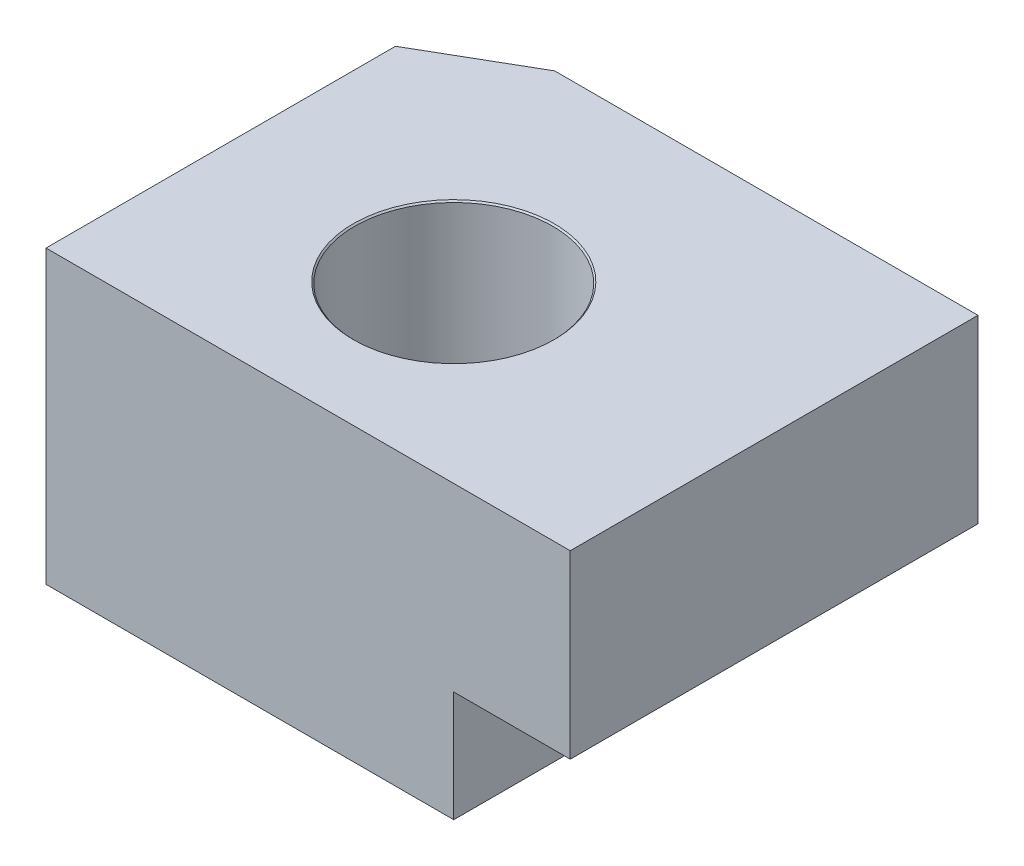
ISO-10303-21;
HEADER;
FILE_DESCRIPTION(('STEP AP214'),'2;1');
FILE_NAME('part.step','',(''),(''),'','','');
FILE_SCHEMA(('AUTOMOTIVE_DESIGN { 1 0 10303 214 1 1 1 1 }'));
ENDSEC;
DATA;
#1=APPLICATION_CONTEXT('core data for automotive mechanical design processes');
#2=APPLICATION_PROTOCOL_DEFINITION('international standard','automotive_design',2000,#1);
#3=PRODUCT_CONTEXT('',#1,'mechanical');
#4=PRODUCT('Part','Part','',(#3));
#5=PRODUCT_RELATED_PRODUCT_CATEGORY('part','',(#4));
#6=PRODUCT_DEFINITION_FORMATION('','',#4);
#7=PRODUCT_DEFINITION_CONTEXT('part definition',#1,'design');
#8=PRODUCT_DEFINITION('design','',#6,#7);
#9=PRODUCT_DEFINITION_SHAPE('','',#8);
#10=(LENGTH_UNIT() NAMED_UNIT(*) SI_UNIT(.MILLI.,.METRE.));
#11=(NAMED_UNIT(*) PLANE_ANGLE_UNIT() SI_UNIT($,.RADIAN.));
#12=(NAMED_UNIT(*) SI_UNIT($,.STERADIAN.) SOLID_ANGLE_UNIT());
#13=UNCERTAINTY_MEASURE_WITH_UNIT(LENGTH_MEASURE(1.E-05),#10,'distance_accuracy_value','');
#14=(GEOMETRIC_REPRESENTATION_CONTEXT(3) GLOBAL_UNCERTAINTY_ASSIGNED_CONTEXT((#13)) GLOBAL_UNIT_ASSIGNED_CONTEXT((#10,
#11,#12)) REPRESENTATION_CONTEXT('',''));
#15=CARTESIAN_POINT('',(0.,0.,0.));
#16=DIRECTION('',(0.,0.,1.));
#17=DIRECTION('',(1.,0.,0.));
#18=AXIS2_PLACEMENT_3D('',#15,#16,#17);
#19=CARTESIAN_POINT('',(-7.,0.,7.));
#20=DIRECTION('',(0.,1.,0.));
#21=DIRECTION('',(0.,0.,1.));
#22=AXIS2_PLACEMENT_3D('',#19,#20,#21);
#23=PLANE('',#22);
#24=CARTESIAN_POINT('',(-3.,0.,4.));
#25=DIRECTION('',(0.,1.,0.));
#26=DIRECTION('',(0.,0.,1.));
#27=AXIS2_PLACEMENT_3D('',#24,#25,#26);
#28=CIRCLE('',#27,1.725);
#29=CARTESIAN_POINT('',(-3.,0.,5.725));
#30=VERTEX_POINT('',#29);
#31=EDGE_CURVE('E150',#30,#30,#28,.T.);
#32=ORIENTED_EDGE('',*,*,#31,.T.);
#33=EDGE_LOOP('',(#32));
#34=FACE_BOUND('',#33,.T.);
#35=DIRECTION('',(0.,0.,-1.));
#36=VECTOR('',#35,1.);
#37=CARTESIAN_POINT('',(-7.,0.,7.));
#38=LINE('',#37,#36);
#39=CARTESIAN_POINT('',(-7.,0.,7.));
#40=VERTEX_POINT('',#39);
#41=CARTESIAN_POINT('',(-7.,0.,1.));
#42=VERTEX_POINT('',#41);
#43=EDGE_CURVE('E125',#40,#42,#38,.T.);
#44=ORIENTED_EDGE('',*,*,#43,.T.);
#45=DIRECTION('',(-0.866025403784438,0.,0.500000000000001));
#46=VECTOR('',#45,1.);
#47=CARTESIAN_POINT('',(-7.,0.,1.));
#48=LINE('',#47,#46);
#49=CARTESIAN_POINT('',(-5.26794919243112,0.,0.));
#50=VERTEX_POINT('',#49);
#51=EDGE_CURVE('E52',#42,#50,#48,.F.);
#52=ORIENTED_EDGE('',*,*,#51,.T.);
#53=DIRECTION('',(1.,0.,0.));
#54=VECTOR('',#53,1.);
#55=CARTESIAN_POINT('',(-7.,0.,0.));
#56=LINE('',#55,#54);
#57=CARTESIAN_POINT('',(0.,0.,0.));
#58=VERTEX_POINT('',#57);
#59=EDGE_CURVE('E107',#50,#58,#56,.T.);
#60=ORIENTED_EDGE('',*,*,#59,.T.);
#61=DIRECTION('',(0.,0.,-1.));
#62=VECTOR('',#61,1.);
#63=CARTESIAN_POINT('',(0.,0.,7.));
#64=LINE('',#63,#62);
#65=CARTESIAN_POINT('',(0.,0.,7.));
#66=VERTEX_POINT('',#65);
#67=EDGE_CURVE('E92',#66,#58,#64,.T.);
#68=ORIENTED_EDGE('',*,*,#67,.F.);
#69=DIRECTION('',(1.,0.,0.));
#70=VECTOR('',#69,1.);
#71=CARTESIAN_POINT('',(-7.,0.,7.));
#72=LINE('',#71,#70);
#73=EDGE_CURVE('E98',#40,#66,#72,.T.);
#74=ORIENTED_EDGE('',*,*,#73,.F.);
#75=EDGE_LOOP('',(#44,#52,#60,#68,#74));
#76=FACE_BOUND('',#75,.T.);
#77=ADVANCED_FACE('F30',(#34,#76),#23,.F.);
#78=CARTESIAN_POINT('',(0.,0.,7.));
#79=DIRECTION('',(-1.,0.,0.));
#80=DIRECTION('',(0.,0.,1.));
#81=AXIS2_PLACEMENT_3D('',#78,#79,#80);
#82=PLANE('',#81);
#83=DIRECTION('',(0.,1.,0.));
#84=VECTOR('',#83,1.);
#85=CARTESIAN_POINT('',(0.,0.,0.));
#86=LINE('',#85,#84);
#87=CARTESIAN_POINT('',(0.,1.9,0.));
#88=VERTEX_POINT('',#87);
#89=EDGE_CURVE('E132',#58,#88,#86,.T.);
#90=ORIENTED_EDGE('',*,*,#89,.T.);
#91=DIRECTION('',(0.,0.,-1.));
#92=VECTOR('',#91,1.);
#93=CARTESIAN_POINT('',(0.,1.9,7.));
#94=LINE('',#93,#92);
#95=CARTESIAN_POINT('',(0.,1.9,7.));
#96=VERTEX_POINT('',#95);
#97=EDGE_CURVE('E94',#96,#88,#94,.T.);
#98=ORIENTED_EDGE('',*,*,#97,.F.);
#99=DIRECTION('',(0.,1.,0.));
#100=VECTOR('',#99,1.);
#101=CARTESIAN_POINT('',(0.,0.,7.));
#102=LINE('',#101,#100);
#103=EDGE_CURVE('E88',#66,#96,#102,.T.);
#104=ORIENTED_EDGE('',*,*,#103,.F.);
#105=ORIENTED_EDGE('',*,*,#67,.T.);
#106=EDGE_LOOP('',(#90,#98,#104,#105));
#107=FACE_BOUND('',#106,.T.);
#108=ADVANCED_FACE('F90',(#107),#82,.F.);
#109=CARTESIAN_POINT('',(0.,1.9,7.));
#110=DIRECTION('',(0.,1.,0.));
#111=DIRECTION('',(0.,0.,1.));
#112=AXIS2_PLACEMENT_3D('',#109,#110,#111);
#113=PLANE('',#112);
#114=DIRECTION('',(1.,0.,0.));
#115=VECTOR('',#114,1.);
#116=CARTESIAN_POINT('',(0.,1.9,0.));
#117=LINE('',#116,#115);
#118=CARTESIAN_POINT('',(2.,1.9,0.));
#119=VERTEX_POINT('',#118);
#120=EDGE_CURVE('E130',#88,#119,#117,.T.);
#121=ORIENTED_EDGE('',*,*,#120,.T.);
#122=DIRECTION('',(0.,0.,-1.));
#123=VECTOR('',#122,1.);
#124=CARTESIAN_POINT('',(2.,1.9,7.));
#125=LINE('',#124,#123);
#126=CARTESIAN_POINT('',(2.,1.9,7.));
#127=VERTEX_POINT('',#126);
#128=EDGE_CURVE('E113',#127,#119,#125,.T.);
#129=ORIENTED_EDGE('',*,*,#128,.F.);
#130=DIRECTION('',(1.,0.,0.));
#131=VECTOR('',#130,1.);
#132=CARTESIAN_POINT('',(0.,1.9,7.));
#133=LINE('',#132,#131);
#134=EDGE_CURVE('E97',#96,#127,#133,.T.);
#135=ORIENTED_EDGE('',*,*,#134,.F.);
#136=ORIENTED_EDGE('',*,*,#97,.T.);
#137=EDGE_LOOP('',(#121,#129,#135,#136));
#138=FACE_BOUND('',#137,.T.);
#139=ADVANCED_FACE('F193',(#138),#113,.F.);
#140=CARTESIAN_POINT('',(2.,1.9,7.));
#141=DIRECTION('',(-1.,0.,0.));
#142=DIRECTION('',(0.,0.,1.));
#143=AXIS2_PLACEMENT_3D('',#140,#141,#142);
#144=PLANE('',#143);
#145=DIRECTION('',(0.,1.,0.));
#146=VECTOR('',#145,1.);
#147=CARTESIAN_POINT('',(2.,1.9,0.));
#148=LINE('',#147,#146);
#149=CARTESIAN_POINT('',(2.,5.,0.));
#150=VERTEX_POINT('',#149);
#151=EDGE_CURVE('E128',#119,#150,#148,.T.);
#152=ORIENTED_EDGE('',*,*,#151,.T.);
#153=DIRECTION('',(0.,0.,-1.));
#154=VECTOR('',#153,1.);
#155=CARTESIAN_POINT('',(2.,5.,7.));
#156=LINE('',#155,#154);
#157=CARTESIAN_POINT('',(2.,5.,7.));
#158=VERTEX_POINT('',#157);
#159=EDGE_CURVE('E119',#158,#150,#156,.T.);
#160=ORIENTED_EDGE('',*,*,#159,.F.);
#161=DIRECTION('',(0.,1.,0.));
#162=VECTOR('',#161,1.);
#163=CARTESIAN_POINT('',(2.,1.9,7.));
#164=LINE('',#163,#162);
#165=EDGE_CURVE('E139',#127,#158,#164,.T.);
#166=ORIENTED_EDGE('',*,*,#165,.F.);
#167=ORIENTED_EDGE('',*,*,#128,.T.);
#168=EDGE_LOOP('',(#152,#160,#166,#167));
#169=FACE_BOUND('',#168,.T.);
#170=ADVANCED_FACE('F178',(#169),#144,.F.);
#171=CARTESIAN_POINT('',(2.,5.,7.));
#172=DIRECTION('',(0.,-1.,0.));
#173=DIRECTION('',(1.,0.,0.));
#174=AXIS2_PLACEMENT_3D('',#171,#172,#173);
#175=PLANE('',#174);
#176=CARTESIAN_POINT('',(-3.,5.,4.));
#177=DIRECTION('',(0.,1.,0.));
#178=DIRECTION('',(0.,0.,1.));
#179=AXIS2_PLACEMENT_3D('',#176,#177,#178);
#180=CIRCLE('',#179,1.725);
#181=CARTESIAN_POINT('',(-3.,5.,5.725));
#182=VERTEX_POINT('',#181);
#183=EDGE_CURVE('E147',#182,#182,#180,.T.);
#184=ORIENTED_EDGE('',*,*,#183,.F.);
#185=EDGE_LOOP('',(#184));
#186=FACE_BOUND('',#185,.T.);
#187=DIRECTION('',(-1.,0.,0.));
#188=VECTOR('',#187,1.);
#189=CARTESIAN_POINT('',(2.,5.,0.));
#190=LINE('',#189,#188);
#191=CARTESIAN_POINT('',(-5.26794919243111,5.,0.));
#192=VERTEX_POINT('',#191);
#193=EDGE_CURVE('E105',#150,#192,#190,.T.);
#194=ORIENTED_EDGE('',*,*,#193,.T.);
#195=DIRECTION('',(0.866025403784438,0.,-0.500000000000001));
#196=VECTOR('',#195,1.);
#197=CARTESIAN_POINT('',(-7.,5.,1.));
#198=LINE('',#197,#196);
#199=CARTESIAN_POINT('',(-7.,5.,1.));
#200=VERTEX_POINT('',#199);
#201=EDGE_CURVE('E11',#192,#200,#198,.F.);
#202=ORIENTED_EDGE('',*,*,#201,.T.);
#203=DIRECTION('',(0.,0.,-1.));
#204=VECTOR('',#203,1.);
#205=CARTESIAN_POINT('',(-7.,5.,7.));
#206=LINE('',#205,#204);
#207=CARTESIAN_POINT('',(-7.,5.,7.));
#208=VERTEX_POINT('',#207);
#209=EDGE_CURVE('E122',#208,#200,#206,.T.);
#210=ORIENTED_EDGE('',*,*,#209,.F.);
#211=DIRECTION('',(-1.,0.,0.));
#212=VECTOR('',#211,1.);
#213=CARTESIAN_POINT('',(2.,5.,7.));
#214=LINE('',#213,#212);
#215=EDGE_CURVE('E137',#158,#208,#214,.T.);
#216=ORIENTED_EDGE('',*,*,#215,.F.);
#217=ORIENTED_EDGE('',*,*,#159,.T.);
#218=EDGE_LOOP('',(#194,#202,#210,#216,#217));
#219=FACE_BOUND('',#218,.T.);
#220=ADVANCED_FACE('F174',(#186,#219),#175,.F.);
#221=CARTESIAN_POINT('',(-7.,5.,7.));
#222=DIRECTION('',(1.,0.,0.));
#223=DIRECTION('',(0.,0.,-1.));
#224=AXIS2_PLACEMENT_3D('',#221,#222,#223);
#225=PLANE('',#224);
#226=ORIENTED_EDGE('',*,*,#209,.T.);
#227=DIRECTION('',(0.,-1.,0.));
#228=VECTOR('',#227,1.);
#229=CARTESIAN_POINT('',(-7.,5.,1.));
#230=LINE('',#229,#228);
#231=EDGE_CURVE('E109',#200,#42,#230,.T.);
#232=ORIENTED_EDGE('',*,*,#231,.T.);
#233=ORIENTED_EDGE('',*,*,#43,.F.);
#234=DIRECTION('',(0.,-1.,0.));
#235=VECTOR('',#234,1.);
#236=CARTESIAN_POINT('',(-7.,5.,7.));
#237=LINE('',#236,#235);
#238=EDGE_CURVE('E103',#208,#40,#237,.T.);
#239=ORIENTED_EDGE('',*,*,#238,.F.);
#240=EDGE_LOOP('',(#226,#232,#233,#239));
#241=FACE_BOUND('',#240,.T.);
#242=ADVANCED_FACE('F177',(#241),#225,.F.);
#243=CARTESIAN_POINT('',(0.,0.,7.));
#244=DIRECTION('',(0.,0.,1.));
#245=DIRECTION('',(1.,0.,0.));
#246=AXIS2_PLACEMENT_3D('',#243,#244,#245);
#247=PLANE('',#246);
#248=ORIENTED_EDGE('',*,*,#73,.T.);
#249=ORIENTED_EDGE('',*,*,#103,.T.);
#250=ORIENTED_EDGE('',*,*,#134,.T.);
#251=ORIENTED_EDGE('',*,*,#165,.T.);
#252=ORIENTED_EDGE('',*,*,#215,.T.);
#253=ORIENTED_EDGE('',*,*,#238,.T.);
#254=EDGE_LOOP('',(#248,#249,#250,#251,#252,#253));
#255=FACE_BOUND('',#254,.T.);
#256=ADVANCED_FACE('F101',(#255),#247,.T.);
#257=CARTESIAN_POINT('',(0.,0.,0.));
#258=DIRECTION('',(0.,0.,1.));
#259=DIRECTION('',(1.,0.,0.));
#260=AXIS2_PLACEMENT_3D('',#257,#258,#259);
#261=PLANE('',#260);
#262=ORIENTED_EDGE('',*,*,#59,.F.);
#263=DIRECTION('',(0.,1.,0.));
#264=VECTOR('',#263,1.);
#265=CARTESIAN_POINT('',(-5.26794919243112,0.,0.));
#266=LINE('',#265,#264);
#267=EDGE_CURVE('E38',#50,#192,#266,.T.);
#268=ORIENTED_EDGE('',*,*,#267,.T.);
#269=ORIENTED_EDGE('',*,*,#193,.F.);
#270=ORIENTED_EDGE('',*,*,#151,.F.);
#271=ORIENTED_EDGE('',*,*,#120,.F.);
#272=ORIENTED_EDGE('',*,*,#89,.F.);
#273=EDGE_LOOP('',(#262,#268,#269,#270,#271,#272));
#274=FACE_BOUND('',#273,.T.);
#275=ADVANCED_FACE('F159',(#274),#261,.F.);
#276=CARTESIAN_POINT('',(-3.,0.0250000000000016,4.));
#277=DIRECTION('',(0.,-1.,0.));
#278=DIRECTION('',(0.,0.,-1.));
#279=AXIS2_PLACEMENT_3D('',#276,#277,#278);
#280=CONICAL_SURFACE('',#279,1.7,0.785398163397405);
#281=ORIENTED_EDGE('',*,*,#31,.F.);
#282=EDGE_LOOP('',(#281));
#283=FACE_BOUND('',#282,.T.);
#284=CARTESIAN_POINT('',(-3.,0.0250000000000016,4.));
#285=DIRECTION('',(0.,1.,0.));
#286=DIRECTION('',(0.,0.,1.));
#287=AXIS2_PLACEMENT_3D('',#284,#285,#286);
#288=CIRCLE('',#287,1.7);
#289=CARTESIAN_POINT('',(-3.,0.0250000000000016,5.7));
#290=VERTEX_POINT('',#289);
#291=EDGE_CURVE('E135',#290,#290,#288,.T.);
#292=ORIENTED_EDGE('',*,*,#291,.T.);
#293=EDGE_LOOP('',(#292));
#294=FACE_BOUND('',#293,.T.);
#295=ADVANCED_FACE('F155',(#283,#294),#280,.F.);
#296=CARTESIAN_POINT('',(-3.,5.,4.));
#297=DIRECTION('',(0.,1.,0.));
#298=DIRECTION('',(0.,0.,1.));
#299=AXIS2_PLACEMENT_3D('',#296,#297,#298);
#300=CYLINDRICAL_SURFACE('',#299,1.7);
#301=ORIENTED_EDGE('',*,*,#291,.F.);
#302=EDGE_LOOP('',(#301));
#303=FACE_BOUND('',#302,.T.);
#304=CARTESIAN_POINT('',(-3.,4.975,4.));
#305=DIRECTION('',(0.,1.,0.));
#306=DIRECTION('',(0.,0.,1.));
#307=AXIS2_PLACEMENT_3D('',#304,#305,#306);
#308=CIRCLE('',#307,1.7);
#309=CARTESIAN_POINT('',(-3.,4.975,5.7));
#310=VERTEX_POINT('',#309);
#311=EDGE_CURVE('E144',#310,#310,#308,.T.);
#312=ORIENTED_EDGE('',*,*,#311,.T.);
#313=EDGE_LOOP('',(#312));
#314=FACE_BOUND('',#313,.T.);
#315=ADVANCED_FACE('F158',(#303,#314),#300,.F.);
#316=CARTESIAN_POINT('',(-3.,5.,4.));
#317=DIRECTION('',(0.,1.,0.));
#318=DIRECTION('',(0.,0.,1.));
#319=AXIS2_PLACEMENT_3D('',#316,#317,#318);
#320=CONICAL_SURFACE('',#319,1.725,0.785398163397453);
#321=ORIENTED_EDGE('',*,*,#311,.F.);
#322=EDGE_LOOP('',(#321));
#323=FACE_BOUND('',#322,.T.);
#324=ORIENTED_EDGE('',*,*,#183,.T.);
#325=EDGE_LOOP('',(#324));
#326=FACE_BOUND('',#325,.T.);
#327=ADVANCED_FACE('F165',(#323,#326),#320,.F.);
#328=CARTESIAN_POINT('',(-7.,5.,1.));
#329=DIRECTION('',(0.500000000000001,0.,0.866025403784438));
#330=DIRECTION('',(0.866025403784438,0.,-0.500000000000001));
#331=AXIS2_PLACEMENT_3D('',#328,#329,#330);
#332=PLANE('',#331);
#333=ORIENTED_EDGE('',*,*,#201,.F.);
#334=ORIENTED_EDGE('',*,*,#267,.F.);
#335=ORIENTED_EDGE('',*,*,#51,.F.);
#336=ORIENTED_EDGE('',*,*,#231,.F.);
#337=EDGE_LOOP('',(#333,#334,#335,#336));
#338=FACE_BOUND('',#337,.T.);
#339=ADVANCED_FACE('F32',(#338),#332,.F.);
#340=CLOSED_SHELL('',(#77,#108,#139,#170,#220,#242,#256,#275,#295,#315,#327,#339));
#341=MANIFOLD_SOLID_BREP('B2',#340);
#342=ADVANCED_BREP_SHAPE_REPRESENTATION('',(#18,#341),#14);
#343=SHAPE_DEFINITION_REPRESENTATION(#9,#342);
ENDSEC;
END-ISO-10303-21;
